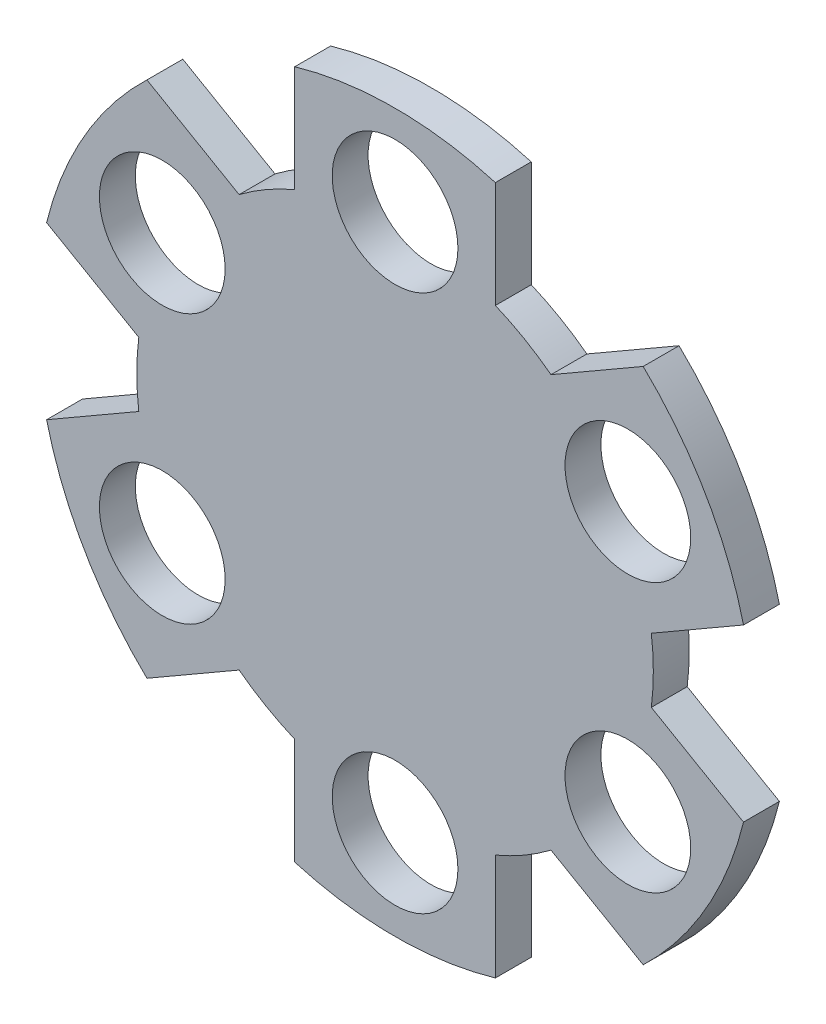
ISO-10303-21;
HEADER;
FILE_DESCRIPTION(('STEP AP214'),'2;1');
FILE_NAME('part.step','',(''),(''),'','','');
FILE_SCHEMA(('AUTOMOTIVE_DESIGN { 1 0 10303 214 1 1 1 1 }'));
ENDSEC;
DATA;
#1=APPLICATION_CONTEXT('core data for automotive mechanical design processes');
#2=APPLICATION_PROTOCOL_DEFINITION('international standard','automotive_design',2000,#1);
#3=PRODUCT_CONTEXT('',#1,'mechanical');
#4=PRODUCT('Part','Part','',(#3));
#5=PRODUCT_RELATED_PRODUCT_CATEGORY('part','',(#4));
#6=PRODUCT_DEFINITION_FORMATION('','',#4);
#7=PRODUCT_DEFINITION_CONTEXT('part definition',#1,'design');
#8=PRODUCT_DEFINITION('design','',#6,#7);
#9=PRODUCT_DEFINITION_SHAPE('','',#8);
#10=(LENGTH_UNIT() NAMED_UNIT(*) SI_UNIT(.MILLI.,.METRE.));
#11=(NAMED_UNIT(*) PLANE_ANGLE_UNIT() SI_UNIT($,.RADIAN.));
#12=(NAMED_UNIT(*) SI_UNIT($,.STERADIAN.) SOLID_ANGLE_UNIT());
#13=UNCERTAINTY_MEASURE_WITH_UNIT(LENGTH_MEASURE(1.E-05),#10,'distance_accuracy_value','');
#14=(GEOMETRIC_REPRESENTATION_CONTEXT(3) GLOBAL_UNCERTAINTY_ASSIGNED_CONTEXT((#13)) GLOBAL_UNIT_ASSIGNED_CONTEXT((#10,
#11,#12)) REPRESENTATION_CONTEXT('',''));
#15=CARTESIAN_POINT('',(0.,0.,0.));
#16=DIRECTION('',(0.,0.,1.));
#17=DIRECTION('',(1.,0.,0.));
#18=AXIS2_PLACEMENT_3D('',#15,#16,#17);
#19=CARTESIAN_POINT('',(0.,0.,3.175));
#20=DIRECTION('',(0.,0.,-1.));
#21=DIRECTION('',(-1.,0.,0.));
#22=AXIS2_PLACEMENT_3D('',#19,#20,#21);
#23=CYLINDRICAL_SURFACE('',#22,31.75);
#24=CARTESIAN_POINT('',(0.,0.,0.));
#25=DIRECTION('',(0.,0.,1.));
#26=DIRECTION('',(1.,0.,0.));
#27=AXIS2_PLACEMENT_3D('',#24,#25,#26);
#28=CIRCLE('',#27,31.75);
#29=CARTESIAN_POINT('',(30.8386744389797,7.5523942459741,0.));
#30=VERTEX_POINT('',#29);
#31=CARTESIAN_POINT('',(21.9599024959468,22.9308783601874,0.));
#32=VERTEX_POINT('',#31);
#33=EDGE_CURVE('E424',#30,#32,#28,.T.);
#34=ORIENTED_EDGE('',*,*,#33,.T.);
#35=DIRECTION('',(0.,0.,-1.));
#36=VECTOR('',#35,1.);
#37=CARTESIAN_POINT('',(21.9599024959468,22.9308783601874,3.175));
#38=LINE('',#37,#36);
#39=CARTESIAN_POINT('',(21.9599024959468,22.9308783601874,3.175));
#40=VERTEX_POINT('',#39);
#41=EDGE_CURVE('E226',#40,#32,#38,.T.);
#42=ORIENTED_EDGE('',*,*,#41,.F.);
#43=CARTESIAN_POINT('',(0.,0.,3.175));
#44=DIRECTION('',(0.,0.,1.));
#45=DIRECTION('',(1.,0.,0.));
#46=AXIS2_PLACEMENT_3D('',#43,#44,#45);
#47=CIRCLE('',#46,31.75);
#48=CARTESIAN_POINT('',(30.8386744390011,7.55239424598647,3.175));
#49=VERTEX_POINT('',#48);
#50=EDGE_CURVE('E437',#49,#40,#47,.T.);
#51=ORIENTED_EDGE('',*,*,#50,.F.);
#52=DIRECTION('',(0.,0.,-1.));
#53=VECTOR('',#52,1.);
#54=CARTESIAN_POINT('',(30.8386744390011,7.55239424598647,3.175));
#55=LINE('',#54,#53);
#56=EDGE_CURVE('E250',#49,#30,#55,.T.);
#57=ORIENTED_EDGE('',*,*,#56,.T.);
#58=EDGE_LOOP('',(#34,#42,#51,#57));
#59=FACE_BOUND('',#58,.T.);
#60=ADVANCED_FACE('F32',(#59),#23,.T.);
#61=CARTESIAN_POINT('',(21.9599024959057,-22.9308783602005,0.));
#62=VERTEX_POINT('',#61);
#63=CARTESIAN_POINT('',(30.8386744390274,-7.55239424603851,0.));
#64=VERTEX_POINT('',#63);
#65=EDGE_CURVE('E427',#62,#64,#28,.T.);
#66=ORIENTED_EDGE('',*,*,#65,.T.);
#67=DIRECTION('',(0.,0.,-1.));
#68=VECTOR('',#67,1.);
#69=CARTESIAN_POINT('',(30.8386744390274,-7.55239424603851,3.175));
#70=LINE('',#69,#68);
#71=CARTESIAN_POINT('',(30.8386744390274,-7.55239424603851,3.175));
#72=VERTEX_POINT('',#71);
#73=EDGE_CURVE('E248',#72,#64,#70,.T.);
#74=ORIENTED_EDGE('',*,*,#73,.F.);
#75=CARTESIAN_POINT('',(21.9599024959611,-22.9308783602325,3.175));
#76=VERTEX_POINT('',#75);
#77=EDGE_CURVE('E459',#76,#72,#47,.T.);
#78=ORIENTED_EDGE('',*,*,#77,.F.);
#79=DIRECTION('',(0.,0.,-1.));
#80=VECTOR('',#79,1.);
#81=CARTESIAN_POINT('',(21.9599024959611,-22.9308783602325,3.175));
#82=LINE('',#81,#80);
#83=EDGE_CURVE('E275',#76,#62,#82,.T.);
#84=ORIENTED_EDGE('',*,*,#83,.T.);
#85=EDGE_LOOP('',(#66,#74,#78,#84));
#86=FACE_BOUND('',#85,.T.);
#87=ADVANCED_FACE('F414',(#86),#23,.T.);
#88=CARTESIAN_POINT('',(-8.87877194303077,-30.4832726061958,0.));
#89=VERTEX_POINT('',#88);
#90=CARTESIAN_POINT('',(8.87877194308978,-30.4832726062678,0.));
#91=VERTEX_POINT('',#90);
#92=EDGE_CURVE('E429',#89,#91,#28,.T.);
#93=ORIENTED_EDGE('',*,*,#92,.T.);
#94=DIRECTION('',(0.,0.,-1.));
#95=VECTOR('',#94,1.);
#96=CARTESIAN_POINT('',(8.87877194308978,-30.4832726062678,3.175));
#97=LINE('',#96,#95);
#98=CARTESIAN_POINT('',(8.87877194308978,-30.4832726062678,3.175));
#99=VERTEX_POINT('',#98);
#100=EDGE_CURVE('E273',#99,#91,#97,.T.);
#101=ORIENTED_EDGE('',*,*,#100,.F.);
#102=CARTESIAN_POINT('',(-8.87877194303078,-30.4832726062609,3.175));
#103=VERTEX_POINT('',#102);
#104=EDGE_CURVE('E457',#103,#99,#47,.T.);
#105=ORIENTED_EDGE('',*,*,#104,.F.);
#106=DIRECTION('',(0.,0.,-1.));
#107=VECTOR('',#106,1.);
#108=CARTESIAN_POINT('',(-8.87877194303078,-30.4832726062609,3.175));
#109=LINE('',#108,#107);
#110=EDGE_CURVE('E301',#103,#89,#109,.T.);
#111=ORIENTED_EDGE('',*,*,#110,.T.);
#112=EDGE_LOOP('',(#93,#101,#105,#111));
#113=FACE_BOUND('',#112,.T.);
#114=ADVANCED_FACE('F419',(#113),#23,.T.);
#115=CARTESIAN_POINT('',(-30.8386744389594,-7.55239424605679,0.));
#116=VERTEX_POINT('',#115);
#117=CARTESIAN_POINT('',(-21.9599024959284,-22.9308783602711,0.));
#118=VERTEX_POINT('',#117);
#119=EDGE_CURVE('E433',#116,#118,#28,.T.);
#120=ORIENTED_EDGE('',*,*,#119,.T.);
#121=DIRECTION('',(0.,0.,-1.));
#122=VECTOR('',#121,1.);
#123=CARTESIAN_POINT('',(-21.9599024959284,-22.9308783602711,3.175));
#124=LINE('',#123,#122);
#125=CARTESIAN_POINT('',(-21.9599024959284,-22.9308783602711,3.175));
#126=VERTEX_POINT('',#125);
#127=EDGE_CURVE('E299',#126,#118,#124,.T.);
#128=ORIENTED_EDGE('',*,*,#127,.F.);
#129=CARTESIAN_POINT('',(-30.8386744389827,-7.55239424607024,3.175));
#130=VERTEX_POINT('',#129);
#131=EDGE_CURVE('E41',#130,#126,#47,.T.);
#132=ORIENTED_EDGE('',*,*,#131,.F.);
#133=DIRECTION('',(0.,0.,-1.));
#134=VECTOR('',#133,1.);
#135=CARTESIAN_POINT('',(-30.8386744389827,-7.55239424607024,3.175));
#136=LINE('',#135,#134);
#137=EDGE_CURVE('E327',#130,#116,#136,.T.);
#138=ORIENTED_EDGE('',*,*,#137,.T.);
#139=EDGE_LOOP('',(#120,#128,#132,#138));
#140=FACE_BOUND('',#139,.T.);
#141=ADVANCED_FACE('F552',(#140),#23,.T.);
#142=CARTESIAN_POINT('',(-21.9599024959534,22.9308783601549,0.));
#143=VERTEX_POINT('',#142);
#144=CARTESIAN_POINT('',(-30.838674439009,7.55239424595475,0.));
#145=VERTEX_POINT('',#144);
#146=EDGE_CURVE('E36',#143,#145,#28,.T.);
#147=ORIENTED_EDGE('',*,*,#146,.T.);
#148=DIRECTION('',(0.,0.,-1.));
#149=VECTOR('',#148,1.);
#150=CARTESIAN_POINT('',(-30.838674439009,7.55239424595475,3.175));
#151=LINE('',#150,#149);
#152=CARTESIAN_POINT('',(-30.838674439009,7.55239424595475,3.175));
#153=VERTEX_POINT('',#152);
#154=EDGE_CURVE('E325',#153,#145,#151,.T.);
#155=ORIENTED_EDGE('',*,*,#154,.F.);
#156=CARTESIAN_POINT('',(-21.9599024959428,22.9308783601487,3.175));
#157=VERTEX_POINT('',#156);
#158=EDGE_CURVE('E11',#157,#153,#47,.T.);
#159=ORIENTED_EDGE('',*,*,#158,.F.);
#160=DIRECTION('',(0.,0.,-1.));
#161=VECTOR('',#160,1.);
#162=CARTESIAN_POINT('',(-21.9599024959428,22.9308783601487,3.175));
#163=LINE('',#162,#161);
#164=EDGE_CURVE('E354',#157,#143,#163,.T.);
#165=ORIENTED_EDGE('',*,*,#164,.T.);
#166=EDGE_LOOP('',(#147,#155,#159,#165));
#167=FACE_BOUND('',#166,.T.);
#168=ADVANCED_FACE('F411',(#167),#23,.T.);
#169=CARTESIAN_POINT('',(0.,0.,3.175));
#170=DIRECTION('',(0.,0.,1.));
#171=DIRECTION('',(1.,0.,0.));
#172=AXIS2_PLACEMENT_3D('',#169,#170,#171);
#173=PLANE('',#172);
#174=DIRECTION('',(-0.866025403784438,-0.500000000000001,0.));
#175=VECTOR('',#174,1.);
#176=CARTESIAN_POINT('',(13.8006085226078,18.2201077882828,3.175));
#177=LINE('',#176,#175);
#178=CARTESIAN_POINT('',(13.8006085226078,18.2201077882828,3.175));
#179=VERTEX_POINT('',#178);
#180=EDGE_CURVE('E204',#40,#179,#177,.T.);
#181=ORIENTED_EDGE('',*,*,#180,.T.);
#182=CARTESIAN_POINT('',(1.45954906846256E-12,-4.35868577823845E-11,3.175));
#183=DIRECTION('',(0.,0.,1.));
#184=DIRECTION('',(1.,0.,0.));
#185=AXIS2_PLACEMENT_3D('',#182,#183,#184);
#186=CIRCLE('',#185,22.8567084990921);
#187=CARTESIAN_POINT('',(8.87877194304915,21.0617314623936,3.175));
#188=VERTEX_POINT('',#187);
#189=EDGE_CURVE('E199',#179,#188,#186,.T.);
#190=ORIENTED_EDGE('',*,*,#189,.T.);
#191=DIRECTION('',(0.,1.,0.));
#192=VECTOR('',#191,1.);
#193=CARTESIAN_POINT('',(8.87877194304915,30.4832726061771,3.175));
#194=LINE('',#193,#192);
#195=CARTESIAN_POINT('',(8.87877194304915,30.4832726061771,3.175));
#196=VERTEX_POINT('',#195);
#197=EDGE_CURVE('E207',#188,#196,#194,.T.);
#198=ORIENTED_EDGE('',*,*,#197,.T.);
#199=CARTESIAN_POINT('',(-8.8787719430714,30.483272606184,3.175));
#200=VERTEX_POINT('',#199);
#201=EDGE_CURVE('E42',#196,#200,#47,.T.);
#202=ORIENTED_EDGE('',*,*,#201,.T.);
#203=DIRECTION('',(0.,-1.,0.));
#204=VECTOR('',#203,1.);
#205=CARTESIAN_POINT('',(-8.87877194307139,21.0617314623749,3.175));
#206=LINE('',#205,#204);
#207=CARTESIAN_POINT('',(-8.87877194307139,21.0617314623749,3.175));
#208=VERTEX_POINT('',#207);
#209=EDGE_CURVE('E338',#200,#208,#206,.T.);
#210=ORIENTED_EDGE('',*,*,#209,.T.);
#211=CARTESIAN_POINT('',(1.69316229452944E-11,-4.01642589743796E-11,3.175));
#212=DIRECTION('',(0.,0.,1.));
#213=DIRECTION('',(1.,0.,0.));
#214=AXIS2_PLACEMENT_3D('',#211,#212,#213);
#215=CIRCLE('',#214,22.8567084990891);
#216=CARTESIAN_POINT('',(-13.8006085226259,18.220107788257,3.175));
#217=VERTEX_POINT('',#216);
#218=EDGE_CURVE('E331',#208,#217,#215,.T.);
#219=ORIENTED_EDGE('',*,*,#218,.T.);
#220=DIRECTION('',(-0.866025403784439,0.5,0.));
#221=VECTOR('',#220,1.);
#222=CARTESIAN_POINT('',(-13.8006085226259,18.220107788257,3.175));
#223=LINE('',#222,#221);
#224=EDGE_CURVE('E334',#217,#157,#223,.T.);
#225=ORIENTED_EDGE('',*,*,#224,.T.);
#226=ORIENTED_EDGE('',*,*,#158,.T.);
#227=DIRECTION('',(0.866025403784439,-0.499999999999999,0.));
#228=VECTOR('',#227,1.);
#229=CARTESIAN_POINT('',(-22.67938046567,2.84162367405021,3.175));
#230=LINE('',#229,#228);
#231=CARTESIAN_POINT('',(-22.67938046567,2.84162367405021,3.175));
#232=VERTEX_POINT('',#231);
#233=EDGE_CURVE('E312',#153,#232,#230,.T.);
#234=ORIENTED_EDGE('',*,*,#233,.T.);
#235=CARTESIAN_POINT('',(1.15815757187391E-11,-3.43203041630979E-11,3.175));
#236=DIRECTION('',(0.,0.,1.));
#237=DIRECTION('',(1.,0.,0.));
#238=AXIS2_PLACEMENT_3D('',#235,#236,#237);
#239=CIRCLE('',#238,22.8567084990891);
#240=CARTESIAN_POINT('',(-22.6793804656659,-2.84162367417849,3.175));
#241=VERTEX_POINT('',#240);
#242=EDGE_CURVE('E305',#232,#241,#239,.T.);
#243=ORIENTED_EDGE('',*,*,#242,.T.);
#244=DIRECTION('',(-0.866025403784439,-0.5,0.));
#245=VECTOR('',#244,1.);
#246=CARTESIAN_POINT('',(-22.6793804656659,-2.84162367417849,3.175));
#247=LINE('',#246,#245);
#248=EDGE_CURVE('E308',#241,#130,#247,.T.);
#249=ORIENTED_EDGE('',*,*,#248,.T.);
#250=ORIENTED_EDGE('',*,*,#131,.T.);
#251=DIRECTION('',(0.866025403784438,0.500000000000001,0.));
#252=VECTOR('',#251,1.);
#253=CARTESIAN_POINT('',(-13.8006085225894,-18.2201077883666,3.175));
#254=LINE('',#253,#252);
#255=CARTESIAN_POINT('',(-13.8006085225894,-18.2201077883666,3.175));
#256=VERTEX_POINT('',#255);
#257=EDGE_CURVE('E286',#126,#256,#254,.T.);
#258=ORIENTED_EDGE('',*,*,#257,.T.);
#259=CARTESIAN_POINT('',(3.84553878032322E-12,-3.60316035671003E-11,3.175));
#260=DIRECTION('',(0.,0.,1.));
#261=DIRECTION('',(1.,0.,0.));
#262=AXIS2_PLACEMENT_3D('',#259,#260,#261);
#263=CIRCLE('',#262,22.8567084990891);
#264=CARTESIAN_POINT('',(-8.87877194303077,-21.0617314624774,3.175));
#265=VERTEX_POINT('',#264);
#266=EDGE_CURVE('E279',#256,#265,#263,.T.);
#267=ORIENTED_EDGE('',*,*,#266,.T.);
#268=DIRECTION('',(0.,-1.,0.));
#269=VECTOR('',#268,1.);
#270=CARTESIAN_POINT('',(-8.87877194303077,-21.0617314624774,3.175));
#271=LINE('',#270,#269);
#272=EDGE_CURVE('E282',#265,#103,#271,.T.);
#273=ORIENTED_EDGE('',*,*,#272,.T.);
#274=ORIENTED_EDGE('',*,*,#104,.T.);
#275=DIRECTION('',(0.,1.,0.));
#276=VECTOR('',#275,1.);
#277=CARTESIAN_POINT('',(8.87877194308978,-21.0617314624587,3.175));
#278=LINE('',#277,#276);
#279=CARTESIAN_POINT('',(8.87877194308978,-21.0617314624587,3.175));
#280=VERTEX_POINT('',#279);
#281=EDGE_CURVE('E260',#99,#280,#278,.T.);
#282=ORIENTED_EDGE('',*,*,#281,.T.);
#283=CARTESIAN_POINT('',(1.45954906846256E-12,-4.35868577823845E-11,3.175));
#284=DIRECTION('',(0.,0.,1.));
#285=DIRECTION('',(1.,0.,0.));
#286=AXIS2_PLACEMENT_3D('',#283,#284,#285);
#287=CIRCLE('',#286,22.8567084990891);
#288=CARTESIAN_POINT('',(13.8006085226443,-18.2201077883407,3.175));
#289=VERTEX_POINT('',#288);
#290=EDGE_CURVE('E253',#280,#289,#287,.T.);
#291=ORIENTED_EDGE('',*,*,#290,.T.);
#292=DIRECTION('',(0.866025403784438,-0.5,0.));
#293=VECTOR('',#292,1.);
#294=CARTESIAN_POINT('',(13.8006085226443,-18.2201077883407,3.175));
#295=LINE('',#294,#293);
#296=EDGE_CURVE('E256',#289,#76,#295,.T.);
#297=ORIENTED_EDGE('',*,*,#296,.T.);
#298=ORIENTED_EDGE('',*,*,#77,.T.);
#299=DIRECTION('',(-0.866025403784439,0.5,0.));
#300=VECTOR('',#299,1.);
#301=CARTESIAN_POINT('',(22.6793804656884,-2.84162367413396,3.175));
#302=LINE('',#301,#300);
#303=CARTESIAN_POINT('',(22.6793804656884,-2.84162367413396,3.175));
#304=VERTEX_POINT('',#303);
#305=EDGE_CURVE('E236',#72,#304,#302,.T.);
#306=ORIENTED_EDGE('',*,*,#305,.T.);
#307=CARTESIAN_POINT('',(6.80959629501781E-12,-4.94308125936663E-11,3.175));
#308=DIRECTION('',(0.,0.,1.));
#309=DIRECTION('',(1.,0.,0.));
#310=AXIS2_PLACEMENT_3D('',#307,#308,#309);
#311=CIRCLE('',#310,22.8567084990891);
#312=CARTESIAN_POINT('',(22.6793804656843,2.84162367409473,3.175));
#313=VERTEX_POINT('',#312);
#314=EDGE_CURVE('E229',#304,#313,#311,.T.);
#315=ORIENTED_EDGE('',*,*,#314,.T.);
#316=DIRECTION('',(0.866025403784439,0.5,0.));
#317=VECTOR('',#316,1.);
#318=CARTESIAN_POINT('',(22.6793804656843,2.84162367409473,3.175));
#319=LINE('',#318,#317);
#320=EDGE_CURVE('E232',#313,#49,#319,.T.);
#321=ORIENTED_EDGE('',*,*,#320,.T.);
#322=ORIENTED_EDGE('',*,*,#50,.T.);
#323=EDGE_LOOP('',(#181,#190,#198,#202,#210,#219,#225,#226,#234,#243,#249,#250,#258,#267,#273,
#274,#282,#291,#297,#298,#306,#315,#321,#322));
#324=FACE_BOUND('',#323,.T.);
#325=CARTESIAN_POINT('',(-20.6025178388072,-11.8948692202191,3.175));
#326=DIRECTION('',(0.,0.,1.));
#327=DIRECTION('',(1.,0.,0.));
#328=AXIS2_PLACEMENT_3D('',#325,#326,#327);
#329=CIRCLE('',#328,5.5626);
#330=CARTESIAN_POINT('',(-15.0399178388072,-11.8948692202191,3.175));
#331=VERTEX_POINT('',#330);
#332=EDGE_CURVE('E364',#331,#331,#329,.T.);
#333=ORIENTED_EDGE('',*,*,#332,.F.);
#334=EDGE_LOOP('',(#333));
#335=FACE_BOUND('',#334,.T.);
#336=CARTESIAN_POINT('',(20.602517838807,-11.8948692202194,3.175));
#337=DIRECTION('',(0.,0.,1.));
#338=DIRECTION('',(1.,0.,0.));
#339=AXIS2_PLACEMENT_3D('',#336,#337,#338);
#340=CIRCLE('',#339,5.5626);
#341=CARTESIAN_POINT('',(26.165117838807,-11.8948692202194,3.175));
#342=VERTEX_POINT('',#341);
#343=EDGE_CURVE('E376',#342,#342,#340,.T.);
#344=ORIENTED_EDGE('',*,*,#343,.F.);
#345=EDGE_LOOP('',(#344));
#346=FACE_BOUND('',#345,.T.);
#347=CARTESIAN_POINT('',(0.,23.7897384404387,3.175));
#348=DIRECTION('',(0.,0.,1.));
#349=DIRECTION('',(1.,0.,0.));
#350=AXIS2_PLACEMENT_3D('',#347,#348,#349);
#351=CIRCLE('',#350,5.5626);
#352=CARTESIAN_POINT('',(5.5626,23.7897384404387,3.175));
#353=VERTEX_POINT('',#352);
#354=EDGE_CURVE('E388',#353,#353,#351,.T.);
#355=ORIENTED_EDGE('',*,*,#354,.F.);
#356=EDGE_LOOP('',(#355));
#357=FACE_BOUND('',#356,.T.);
#358=CARTESIAN_POINT('',(20.6025178388071,11.8948692202193,3.175));
#359=DIRECTION('',(0.,0.,1.));
#360=DIRECTION('',(1.,0.,0.));
#361=AXIS2_PLACEMENT_3D('',#358,#359,#360);
#362=CIRCLE('',#361,5.5626);
#363=CARTESIAN_POINT('',(26.1651178388071,11.8948692202193,3.175));
#364=VERTEX_POINT('',#363);
#365=EDGE_CURVE('E382',#364,#364,#362,.T.);
#366=ORIENTED_EDGE('',*,*,#365,.F.);
#367=EDGE_LOOP('',(#366));
#368=FACE_BOUND('',#367,.T.);
#369=CARTESIAN_POINT('',(-1.66122951859872E-13,-23.7897384404387,3.175));
#370=DIRECTION('',(0.,0.,1.));
#371=DIRECTION('',(1.,0.,0.));
#372=AXIS2_PLACEMENT_3D('',#369,#370,#371);
#373=CIRCLE('',#372,5.5626);
#374=CARTESIAN_POINT('',(5.56259999999983,-23.7897384404387,3.175));
#375=VERTEX_POINT('',#374);
#376=EDGE_CURVE('E370',#375,#375,#373,.T.);
#377=ORIENTED_EDGE('',*,*,#376,.F.);
#378=EDGE_LOOP('',(#377));
#379=FACE_BOUND('',#378,.T.);
#380=CARTESIAN_POINT('',(-20.6025178388069,11.8948692202196,3.175));
#381=DIRECTION('',(0.,0.,1.));
#382=DIRECTION('',(1.,0.,0.));
#383=AXIS2_PLACEMENT_3D('',#380,#381,#382);
#384=CIRCLE('',#383,5.5626);
#385=CARTESIAN_POINT('',(-15.0399178388069,11.8948692202196,3.175));
#386=VERTEX_POINT('',#385);
#387=EDGE_CURVE('E358',#386,#386,#384,.T.);
#388=ORIENTED_EDGE('',*,*,#387,.F.);
#389=EDGE_LOOP('',(#388));
#390=FACE_BOUND('',#389,.T.);
#391=ADVANCED_FACE('F212',(#324,#335,#346,#357,#368,#379,#390),#173,.T.);
#392=CARTESIAN_POINT('',(0.,0.,0.));
#393=DIRECTION('',(0.,0.,1.));
#394=DIRECTION('',(1.,0.,0.));
#395=AXIS2_PLACEMENT_3D('',#392,#393,#394);
#396=PLANE('',#395);
#397=CARTESIAN_POINT('',(-20.6025178388072,-11.8948692202191,0.));
#398=DIRECTION('',(0.,0.,1.));
#399=DIRECTION('',(1.,0.,0.));
#400=AXIS2_PLACEMENT_3D('',#397,#398,#399);
#401=CIRCLE('',#400,5.5626);
#402=CARTESIAN_POINT('',(-15.0399178388072,-11.8948692202191,0.));
#403=VERTEX_POINT('',#402);
#404=EDGE_CURVE('E361',#403,#403,#401,.T.);
#405=ORIENTED_EDGE('',*,*,#404,.T.);
#406=EDGE_LOOP('',(#405));
#407=FACE_BOUND('',#406,.T.);
#408=CARTESIAN_POINT('',(20.602517838807,-11.8948692202194,0.));
#409=DIRECTION('',(0.,0.,1.));
#410=DIRECTION('',(1.,0.,0.));
#411=AXIS2_PLACEMENT_3D('',#408,#409,#410);
#412=CIRCLE('',#411,5.5626);
#413=CARTESIAN_POINT('',(26.165117838807,-11.8948692202194,0.));
#414=VERTEX_POINT('',#413);
#415=EDGE_CURVE('E373',#414,#414,#412,.T.);
#416=ORIENTED_EDGE('',*,*,#415,.T.);
#417=EDGE_LOOP('',(#416));
#418=FACE_BOUND('',#417,.T.);
#419=CARTESIAN_POINT('',(0.,23.7897384404387,0.));
#420=DIRECTION('',(0.,0.,1.));
#421=DIRECTION('',(1.,0.,0.));
#422=AXIS2_PLACEMENT_3D('',#419,#420,#421);
#423=CIRCLE('',#422,5.5626);
#424=CARTESIAN_POINT('',(5.5626,23.7897384404387,0.));
#425=VERTEX_POINT('',#424);
#426=EDGE_CURVE('E385',#425,#425,#423,.T.);
#427=ORIENTED_EDGE('',*,*,#426,.T.);
#428=EDGE_LOOP('',(#427));
#429=FACE_BOUND('',#428,.T.);
#430=CARTESIAN_POINT('',(1.45954906846256E-12,-4.35868577823845E-11,0.));
#431=DIRECTION('',(0.,0.,1.));
#432=DIRECTION('',(1.,0.,0.));
#433=AXIS2_PLACEMENT_3D('',#430,#431,#432);
#434=CIRCLE('',#433,22.8567084990921);
#435=CARTESIAN_POINT('',(13.8006085226078,18.2201077882828,0.));
#436=VERTEX_POINT('',#435);
#437=CARTESIAN_POINT('',(8.87877194304915,21.0617314623936,0.));
#438=VERTEX_POINT('',#437);
#439=EDGE_CURVE('E202',#436,#438,#434,.T.);
#440=ORIENTED_EDGE('',*,*,#439,.F.);
#441=DIRECTION('',(-0.866025403784438,-0.500000000000001,0.));
#442=VECTOR('',#441,1.);
#443=CARTESIAN_POINT('',(13.8006085226078,18.2201077882828,0.));
#444=LINE('',#443,#442);
#445=EDGE_CURVE('E215',#32,#436,#444,.T.);
#446=ORIENTED_EDGE('',*,*,#445,.F.);
#447=ORIENTED_EDGE('',*,*,#33,.F.);
#448=DIRECTION('',(0.866025403784439,0.5,0.));
#449=VECTOR('',#448,1.);
#450=CARTESIAN_POINT('',(22.6793804656843,2.84162367409473,0.));
#451=LINE('',#450,#449);
#452=CARTESIAN_POINT('',(22.6793804656843,2.84162367409473,0.));
#453=VERTEX_POINT('',#452);
#454=EDGE_CURVE('E57',#453,#30,#451,.T.);
#455=ORIENTED_EDGE('',*,*,#454,.F.);
#456=CARTESIAN_POINT('',(6.80959629501781E-12,-4.94308125936663E-11,0.));
#457=DIRECTION('',(0.,0.,1.));
#458=DIRECTION('',(1.,0.,0.));
#459=AXIS2_PLACEMENT_3D('',#456,#457,#458);
#460=CIRCLE('',#459,22.8567084990891);
#461=CARTESIAN_POINT('',(22.6793804656884,-2.84162367413396,0.));
#462=VERTEX_POINT('',#461);
#463=EDGE_CURVE('E225',#462,#453,#460,.T.);
#464=ORIENTED_EDGE('',*,*,#463,.F.);
#465=DIRECTION('',(-0.866025403784439,0.5,0.));
#466=VECTOR('',#465,1.);
#467=CARTESIAN_POINT('',(22.6793804656884,-2.84162367413396,0.));
#468=LINE('',#467,#466);
#469=EDGE_CURVE('E233',#64,#462,#468,.T.);
#470=ORIENTED_EDGE('',*,*,#469,.F.);
#471=ORIENTED_EDGE('',*,*,#65,.F.);
#472=DIRECTION('',(0.866025403784438,-0.5,0.));
#473=VECTOR('',#472,1.);
#474=CARTESIAN_POINT('',(13.8006085226443,-18.2201077883407,0.));
#475=LINE('',#474,#473);
#476=CARTESIAN_POINT('',(13.8006085226443,-18.2201077883407,0.));
#477=VERTEX_POINT('',#476);
#478=EDGE_CURVE('E266',#477,#62,#475,.T.);
#479=ORIENTED_EDGE('',*,*,#478,.F.);
#480=CARTESIAN_POINT('',(1.45954906846256E-12,-4.35868577823845E-11,0.));
#481=DIRECTION('',(0.,0.,1.));
#482=DIRECTION('',(1.,0.,0.));
#483=AXIS2_PLACEMENT_3D('',#480,#481,#482);
#484=CIRCLE('',#483,22.8567084990891);
#485=CARTESIAN_POINT('',(8.87877194308978,-21.0617314624587,0.));
#486=VERTEX_POINT('',#485);
#487=EDGE_CURVE('E247',#486,#477,#484,.T.);
#488=ORIENTED_EDGE('',*,*,#487,.F.);
#489=DIRECTION('',(0.,1.,0.));
#490=VECTOR('',#489,1.);
#491=CARTESIAN_POINT('',(8.87877194308978,-21.0617314624587,0.));
#492=LINE('',#491,#490);
#493=EDGE_CURVE('E257',#91,#486,#492,.T.);
#494=ORIENTED_EDGE('',*,*,#493,.F.);
#495=ORIENTED_EDGE('',*,*,#92,.F.);
#496=DIRECTION('',(0.,-1.,0.));
#497=VECTOR('',#496,1.);
#498=CARTESIAN_POINT('',(-8.87877194303077,-21.0617314624774,0.));
#499=LINE('',#498,#497);
#500=CARTESIAN_POINT('',(-8.87877194303077,-21.0617314624774,0.));
#501=VERTEX_POINT('',#500);
#502=EDGE_CURVE('E292',#501,#89,#499,.T.);
#503=ORIENTED_EDGE('',*,*,#502,.F.);
#504=CARTESIAN_POINT('',(3.84553878032322E-12,-3.60316035671003E-11,0.));
#505=DIRECTION('',(0.,0.,1.));
#506=DIRECTION('',(1.,0.,0.));
#507=AXIS2_PLACEMENT_3D('',#504,#505,#506);
#508=CIRCLE('',#507,22.8567084990891);
#509=CARTESIAN_POINT('',(-13.8006085225894,-18.2201077883666,0.));
#510=VERTEX_POINT('',#509);
#511=EDGE_CURVE('E272',#510,#501,#508,.T.);
#512=ORIENTED_EDGE('',*,*,#511,.F.);
#513=DIRECTION('',(0.866025403784438,0.500000000000001,0.));
#514=VECTOR('',#513,1.);
#515=CARTESIAN_POINT('',(-13.8006085225894,-18.2201077883666,0.));
#516=LINE('',#515,#514);
#517=EDGE_CURVE('E283',#118,#510,#516,.T.);
#518=ORIENTED_EDGE('',*,*,#517,.F.);
#519=ORIENTED_EDGE('',*,*,#119,.F.);
#520=DIRECTION('',(-0.866025403784439,-0.5,0.));
#521=VECTOR('',#520,1.);
#522=CARTESIAN_POINT('',(-22.6793804656659,-2.84162367417849,0.));
#523=LINE('',#522,#521);
#524=CARTESIAN_POINT('',(-22.6793804656659,-2.84162367417849,0.));
#525=VERTEX_POINT('',#524);
#526=EDGE_CURVE('E318',#525,#116,#523,.T.);
#527=ORIENTED_EDGE('',*,*,#526,.F.);
#528=CARTESIAN_POINT('',(1.15815757187391E-11,-3.43203041630979E-11,0.));
#529=DIRECTION('',(0.,0.,1.));
#530=DIRECTION('',(1.,0.,0.));
#531=AXIS2_PLACEMENT_3D('',#528,#529,#530);
#532=CIRCLE('',#531,22.8567084990891);
#533=CARTESIAN_POINT('',(-22.67938046567,2.84162367405021,0.));
#534=VERTEX_POINT('',#533);
#535=EDGE_CURVE('E298',#534,#525,#532,.T.);
#536=ORIENTED_EDGE('',*,*,#535,.F.);
#537=DIRECTION('',(0.866025403784439,-0.499999999999999,0.));
#538=VECTOR('',#537,1.);
#539=CARTESIAN_POINT('',(-22.67938046567,2.84162367405021,0.));
#540=LINE('',#539,#538);
#541=EDGE_CURVE('E309',#145,#534,#540,.T.);
#542=ORIENTED_EDGE('',*,*,#541,.F.);
#543=ORIENTED_EDGE('',*,*,#146,.F.);
#544=DIRECTION('',(-0.866025403784439,0.5,0.));
#545=VECTOR('',#544,1.);
#546=CARTESIAN_POINT('',(-13.8006085226259,18.220107788257,0.));
#547=LINE('',#546,#545);
#548=CARTESIAN_POINT('',(-13.8006085226259,18.220107788257,0.));
#549=VERTEX_POINT('',#548);
#550=EDGE_CURVE('E344',#549,#143,#547,.T.);
#551=ORIENTED_EDGE('',*,*,#550,.F.);
#552=CARTESIAN_POINT('',(1.69316229452944E-11,-4.01642589743796E-11,0.));
#553=DIRECTION('',(0.,0.,1.));
#554=DIRECTION('',(1.,0.,0.));
#555=AXIS2_PLACEMENT_3D('',#552,#553,#554);
#556=CIRCLE('',#555,22.8567084990891);
#557=CARTESIAN_POINT('',(-8.87877194307139,21.0617314623749,0.));
#558=VERTEX_POINT('',#557);
#559=EDGE_CURVE('E324',#558,#549,#556,.T.);
#560=ORIENTED_EDGE('',*,*,#559,.F.);
#561=DIRECTION('',(0.,-1.,0.));
#562=VECTOR('',#561,1.);
#563=CARTESIAN_POINT('',(-8.87877194307139,21.0617314623749,0.));
#564=LINE('',#563,#562);
#565=CARTESIAN_POINT('',(-8.8787719430714,30.483272606184,0.));
#566=VERTEX_POINT('',#565);
#567=EDGE_CURVE('E335',#566,#558,#564,.T.);
#568=ORIENTED_EDGE('',*,*,#567,.F.);
#569=CARTESIAN_POINT('',(8.87877194304915,30.4832726061905,0.));
#570=VERTEX_POINT('',#569);
#571=EDGE_CURVE('E391',#570,#566,#28,.T.);
#572=ORIENTED_EDGE('',*,*,#571,.F.);
#573=DIRECTION('',(0.,1.,0.));
#574=VECTOR('',#573,1.);
#575=CARTESIAN_POINT('',(8.87877194304915,30.4832726061771,0.));
#576=LINE('',#575,#574);
#577=EDGE_CURVE('E49',#438,#570,#576,.T.);
#578=ORIENTED_EDGE('',*,*,#577,.F.);
#579=EDGE_LOOP('',(#440,#446,#447,#455,#464,#470,#471,#479,#488,#494,#495,#503,#512,#518,#519,
#527,#536,#542,#543,#551,#560,#568,#572,#578));
#580=FACE_BOUND('',#579,.T.);
#581=CARTESIAN_POINT('',(20.6025178388071,11.8948692202193,0.));
#582=DIRECTION('',(0.,0.,1.));
#583=DIRECTION('',(1.,0.,0.));
#584=AXIS2_PLACEMENT_3D('',#581,#582,#583);
#585=CIRCLE('',#584,5.5626);
#586=CARTESIAN_POINT('',(26.1651178388071,11.8948692202193,0.));
#587=VERTEX_POINT('',#586);
#588=EDGE_CURVE('E379',#587,#587,#585,.T.);
#589=ORIENTED_EDGE('',*,*,#588,.T.);
#590=EDGE_LOOP('',(#589));
#591=FACE_BOUND('',#590,.T.);
#592=CARTESIAN_POINT('',(-1.66122951859872E-13,-23.7897384404387,0.));
#593=DIRECTION('',(0.,0.,1.));
#594=DIRECTION('',(1.,0.,0.));
#595=AXIS2_PLACEMENT_3D('',#592,#593,#594);
#596=CIRCLE('',#595,5.5626);
#597=CARTESIAN_POINT('',(5.56259999999983,-23.7897384404387,0.));
#598=VERTEX_POINT('',#597);
#599=EDGE_CURVE('E367',#598,#598,#596,.T.);
#600=ORIENTED_EDGE('',*,*,#599,.T.);
#601=EDGE_LOOP('',(#600));
#602=FACE_BOUND('',#601,.T.);
#603=CARTESIAN_POINT('',(-20.6025178388069,11.8948692202196,0.));
#604=DIRECTION('',(0.,0.,1.));
#605=DIRECTION('',(1.,0.,0.));
#606=AXIS2_PLACEMENT_3D('',#603,#604,#605);
#607=CIRCLE('',#606,5.5626);
#608=CARTESIAN_POINT('',(-15.0399178388069,11.8948692202196,0.));
#609=VERTEX_POINT('',#608);
#610=EDGE_CURVE('E350',#609,#609,#607,.T.);
#611=ORIENTED_EDGE('',*,*,#610,.T.);
#612=EDGE_LOOP('',(#611));
#613=FACE_BOUND('',#612,.T.);
#614=ADVANCED_FACE('F395',(#407,#418,#429,#580,#591,#602,#613),#396,.F.);
#615=ORIENTED_EDGE('',*,*,#201,.F.);
#616=DIRECTION('',(0.,0.,-1.));
#617=VECTOR('',#616,1.);
#618=CARTESIAN_POINT('',(8.87877194304915,30.4832726061771,3.175));
#619=LINE('',#618,#617);
#620=EDGE_CURVE('E203',#196,#570,#619,.T.);
#621=ORIENTED_EDGE('',*,*,#620,.T.);
#622=ORIENTED_EDGE('',*,*,#571,.T.);
#623=DIRECTION('',(0.,0.,-1.));
#624=VECTOR('',#623,1.);
#625=CARTESIAN_POINT('',(-8.8787719430714,30.483272606184,3.175));
#626=LINE('',#625,#624);
#627=EDGE_CURVE('E351',#200,#566,#626,.T.);
#628=ORIENTED_EDGE('',*,*,#627,.F.);
#629=EDGE_LOOP('',(#615,#621,#622,#628));
#630=FACE_BOUND('',#629,.T.);
#631=ADVANCED_FACE('F34',(#630),#23,.T.);
#632=CARTESIAN_POINT('',(0.,23.7897384404387,3.175));
#633=DIRECTION('',(0.,0.,-1.));
#634=DIRECTION('',(-1.,0.,0.));
#635=AXIS2_PLACEMENT_3D('',#632,#633,#634);
#636=CYLINDRICAL_SURFACE('',#635,5.5626);
#637=ORIENTED_EDGE('',*,*,#354,.T.);
#638=EDGE_LOOP('',(#637));
#639=FACE_BOUND('',#638,.T.);
#640=ORIENTED_EDGE('',*,*,#426,.F.);
#641=EDGE_LOOP('',(#640));
#642=FACE_BOUND('',#641,.T.);
#643=ADVANCED_FACE('F398',(#639,#642),#636,.F.);
#644=CARTESIAN_POINT('',(20.6025178388071,11.8948692202193,3.175));
#645=DIRECTION('',(0.,0.,-1.));
#646=DIRECTION('',(-1.,0.,0.));
#647=AXIS2_PLACEMENT_3D('',#644,#645,#646);
#648=CYLINDRICAL_SURFACE('',#647,5.5626);
#649=ORIENTED_EDGE('',*,*,#365,.T.);
#650=EDGE_LOOP('',(#649));
#651=FACE_BOUND('',#650,.T.);
#652=ORIENTED_EDGE('',*,*,#588,.F.);
#653=EDGE_LOOP('',(#652));
#654=FACE_BOUND('',#653,.T.);
#655=ADVANCED_FACE('F400',(#651,#654),#648,.F.);
#656=CARTESIAN_POINT('',(20.602517838807,-11.8948692202194,3.175));
#657=DIRECTION('',(0.,0.,-1.));
#658=DIRECTION('',(-1.,0.,0.));
#659=AXIS2_PLACEMENT_3D('',#656,#657,#658);
#660=CYLINDRICAL_SURFACE('',#659,5.5626);
#661=ORIENTED_EDGE('',*,*,#343,.T.);
#662=EDGE_LOOP('',(#661));
#663=FACE_BOUND('',#662,.T.);
#664=ORIENTED_EDGE('',*,*,#415,.F.);
#665=EDGE_LOOP('',(#664));
#666=FACE_BOUND('',#665,.T.);
#667=ADVANCED_FACE('F407',(#663,#666),#660,.F.);
#668=CARTESIAN_POINT('',(-1.66122951859872E-13,-23.7897384404387,3.175));
#669=DIRECTION('',(0.,0.,-1.));
#670=DIRECTION('',(-1.,0.,0.));
#671=AXIS2_PLACEMENT_3D('',#668,#669,#670);
#672=CYLINDRICAL_SURFACE('',#671,5.5626);
#673=ORIENTED_EDGE('',*,*,#376,.T.);
#674=EDGE_LOOP('',(#673));
#675=FACE_BOUND('',#674,.T.);
#676=ORIENTED_EDGE('',*,*,#599,.F.);
#677=EDGE_LOOP('',(#676));
#678=FACE_BOUND('',#677,.T.);
#679=ADVANCED_FACE('F529',(#675,#678),#672,.F.);
#680=CARTESIAN_POINT('',(-20.6025178388072,-11.8948692202191,3.175));
#681=DIRECTION('',(0.,0.,-1.));
#682=DIRECTION('',(-1.,0.,0.));
#683=AXIS2_PLACEMENT_3D('',#680,#681,#682);
#684=CYLINDRICAL_SURFACE('',#683,5.5626);
#685=ORIENTED_EDGE('',*,*,#332,.T.);
#686=EDGE_LOOP('',(#685));
#687=FACE_BOUND('',#686,.T.);
#688=ORIENTED_EDGE('',*,*,#404,.F.);
#689=EDGE_LOOP('',(#688));
#690=FACE_BOUND('',#689,.T.);
#691=ADVANCED_FACE('F525',(#687,#690),#684,.F.);
#692=CARTESIAN_POINT('',(-20.6025178388069,11.8948692202196,3.175));
#693=DIRECTION('',(0.,0.,-1.));
#694=DIRECTION('',(-1.,0.,0.));
#695=AXIS2_PLACEMENT_3D('',#692,#693,#694);
#696=CYLINDRICAL_SURFACE('',#695,5.5626);
#697=ORIENTED_EDGE('',*,*,#387,.T.);
#698=EDGE_LOOP('',(#697));
#699=FACE_BOUND('',#698,.T.);
#700=ORIENTED_EDGE('',*,*,#610,.F.);
#701=EDGE_LOOP('',(#700));
#702=FACE_BOUND('',#701,.T.);
#703=ADVANCED_FACE('F521',(#699,#702),#696,.F.);
#704=CARTESIAN_POINT('',(1.69316229452944E-11,-4.01642589743796E-11,3.175));
#705=DIRECTION('',(0.,0.,-1.));
#706=DIRECTION('',(-1.,0.,0.));
#707=AXIS2_PLACEMENT_3D('',#704,#705,#706);
#708=CYLINDRICAL_SURFACE('',#707,22.8567084990891);
#709=ORIENTED_EDGE('',*,*,#559,.T.);
#710=DIRECTION('',(0.,0.,-1.));
#711=VECTOR('',#710,1.);
#712=CARTESIAN_POINT('',(-13.8006085226259,18.220107788257,3.175));
#713=LINE('',#712,#711);
#714=EDGE_CURVE('E341',#217,#549,#713,.T.);
#715=ORIENTED_EDGE('',*,*,#714,.F.);
#716=ORIENTED_EDGE('',*,*,#218,.F.);
#717=DIRECTION('',(0.,0.,-1.));
#718=VECTOR('',#717,1.);
#719=CARTESIAN_POINT('',(-8.87877194307139,21.0617314623749,3.175));
#720=LINE('',#719,#718);
#721=EDGE_CURVE('E348',#208,#558,#720,.T.);
#722=ORIENTED_EDGE('',*,*,#721,.T.);
#723=EDGE_LOOP('',(#709,#715,#716,#722));
#724=FACE_BOUND('',#723,.T.);
#725=ADVANCED_FACE('F514',(#724),#708,.T.);
#726=CARTESIAN_POINT('',(-8.87877194307139,21.0617314623749,3.175));
#727=DIRECTION('',(1.,0.,0.));
#728=DIRECTION('',(0.,1.,0.));
#729=AXIS2_PLACEMENT_3D('',#726,#727,#728);
#730=PLANE('',#729);
#731=ORIENTED_EDGE('',*,*,#567,.T.);
#732=ORIENTED_EDGE('',*,*,#721,.F.);
#733=ORIENTED_EDGE('',*,*,#209,.F.);
#734=ORIENTED_EDGE('',*,*,#627,.T.);
#735=EDGE_LOOP('',(#731,#732,#733,#734));
#736=FACE_BOUND('',#735,.T.);
#737=ADVANCED_FACE('F511',(#736),#730,.F.);
#738=CARTESIAN_POINT('',(-13.8006085226259,18.220107788257,3.175));
#739=DIRECTION('',(-0.5,-0.866025403784439,0.));
#740=DIRECTION('',(0.866025403784439,-0.5,0.));
#741=AXIS2_PLACEMENT_3D('',#738,#739,#740);
#742=PLANE('',#741);
#743=ORIENTED_EDGE('',*,*,#550,.T.);
#744=ORIENTED_EDGE('',*,*,#164,.F.);
#745=ORIENTED_EDGE('',*,*,#224,.F.);
#746=ORIENTED_EDGE('',*,*,#714,.T.);
#747=EDGE_LOOP('',(#743,#744,#745,#746));
#748=FACE_BOUND('',#747,.T.);
#749=ADVANCED_FACE('F509',(#748),#742,.F.);
#750=CARTESIAN_POINT('',(1.15815757187391E-11,-3.43203041630979E-11,3.175));
#751=DIRECTION('',(0.,0.,-1.));
#752=DIRECTION('',(-1.,0.,0.));
#753=AXIS2_PLACEMENT_3D('',#750,#751,#752);
#754=CYLINDRICAL_SURFACE('',#753,22.8567084990891);
#755=ORIENTED_EDGE('',*,*,#535,.T.);
#756=DIRECTION('',(0.,0.,-1.));
#757=VECTOR('',#756,1.);
#758=CARTESIAN_POINT('',(-22.6793804656659,-2.84162367417849,3.175));
#759=LINE('',#758,#757);
#760=EDGE_CURVE('E315',#241,#525,#759,.T.);
#761=ORIENTED_EDGE('',*,*,#760,.F.);
#762=ORIENTED_EDGE('',*,*,#242,.F.);
#763=DIRECTION('',(0.,0.,-1.));
#764=VECTOR('',#763,1.);
#765=CARTESIAN_POINT('',(-22.67938046567,2.84162367405021,3.175));
#766=LINE('',#765,#764);
#767=EDGE_CURVE('E322',#232,#534,#766,.T.);
#768=ORIENTED_EDGE('',*,*,#767,.T.);
#769=EDGE_LOOP('',(#755,#761,#762,#768));
#770=FACE_BOUND('',#769,.T.);
#771=ADVANCED_FACE('F502',(#770),#754,.T.);
#772=CARTESIAN_POINT('',(-22.67938046567,2.84162367405021,3.175));
#773=DIRECTION('',(0.5,0.866025403784439,0.));
#774=DIRECTION('',(-0.866025403784439,0.499999999999999,0.));
#775=AXIS2_PLACEMENT_3D('',#772,#773,#774);
#776=PLANE('',#775);
#777=ORIENTED_EDGE('',*,*,#541,.T.);
#778=ORIENTED_EDGE('',*,*,#767,.F.);
#779=ORIENTED_EDGE('',*,*,#233,.F.);
#780=ORIENTED_EDGE('',*,*,#154,.T.);
#781=EDGE_LOOP('',(#777,#778,#779,#780));
#782=FACE_BOUND('',#781,.T.);
#783=ADVANCED_FACE('F499',(#782),#776,.F.);
#784=CARTESIAN_POINT('',(-22.6793804656659,-2.84162367417849,3.175));
#785=DIRECTION('',(0.5,-0.866025403784439,0.));
#786=DIRECTION('',(0.866025403784439,0.5,0.));
#787=AXIS2_PLACEMENT_3D('',#784,#785,#786);
#788=PLANE('',#787);
#789=ORIENTED_EDGE('',*,*,#526,.T.);
#790=ORIENTED_EDGE('',*,*,#137,.F.);
#791=ORIENTED_EDGE('',*,*,#248,.F.);
#792=ORIENTED_EDGE('',*,*,#760,.T.);
#793=EDGE_LOOP('',(#789,#790,#791,#792));
#794=FACE_BOUND('',#793,.T.);
#795=ADVANCED_FACE('F497',(#794),#788,.F.);
#796=CARTESIAN_POINT('',(3.84553878032322E-12,-3.60316035671003E-11,3.175));
#797=DIRECTION('',(0.,0.,-1.));
#798=DIRECTION('',(-1.,0.,0.));
#799=AXIS2_PLACEMENT_3D('',#796,#797,#798);
#800=CYLINDRICAL_SURFACE('',#799,22.8567084990891);
#801=ORIENTED_EDGE('',*,*,#511,.T.);
#802=DIRECTION('',(0.,0.,-1.));
#803=VECTOR('',#802,1.);
#804=CARTESIAN_POINT('',(-8.87877194303077,-21.0617314624774,3.175));
#805=LINE('',#804,#803);
#806=EDGE_CURVE('E289',#265,#501,#805,.T.);
#807=ORIENTED_EDGE('',*,*,#806,.F.);
#808=ORIENTED_EDGE('',*,*,#266,.F.);
#809=DIRECTION('',(0.,0.,-1.));
#810=VECTOR('',#809,1.);
#811=CARTESIAN_POINT('',(-13.8006085225894,-18.2201077883666,3.175));
#812=LINE('',#811,#810);
#813=EDGE_CURVE('E296',#256,#510,#812,.T.);
#814=ORIENTED_EDGE('',*,*,#813,.T.);
#815=EDGE_LOOP('',(#801,#807,#808,#814));
#816=FACE_BOUND('',#815,.T.);
#817=ADVANCED_FACE('F492',(#816),#800,.T.);
#818=CARTESIAN_POINT('',(-13.8006085225894,-18.2201077883666,3.175));
#819=DIRECTION('',(-0.500000000000001,0.866025403784438,0.));
#820=DIRECTION('',(-0.866025403784438,-0.500000000000001,0.));
#821=AXIS2_PLACEMENT_3D('',#818,#819,#820);
#822=PLANE('',#821);
#823=ORIENTED_EDGE('',*,*,#517,.T.);
#824=ORIENTED_EDGE('',*,*,#813,.F.);
#825=ORIENTED_EDGE('',*,*,#257,.F.);
#826=ORIENTED_EDGE('',*,*,#127,.T.);
#827=EDGE_LOOP('',(#823,#824,#825,#826));
#828=FACE_BOUND('',#827,.T.);
#829=ADVANCED_FACE('F486',(#828),#822,.F.);
#830=CARTESIAN_POINT('',(-8.87877194303077,-21.0617314624774,3.175));
#831=DIRECTION('',(1.,0.,0.));
#832=DIRECTION('',(0.,1.,0.));
#833=AXIS2_PLACEMENT_3D('',#830,#831,#832);
#834=PLANE('',#833);
#835=ORIENTED_EDGE('',*,*,#502,.T.);
#836=ORIENTED_EDGE('',*,*,#110,.F.);
#837=ORIENTED_EDGE('',*,*,#272,.F.);
#838=ORIENTED_EDGE('',*,*,#806,.T.);
#839=EDGE_LOOP('',(#835,#836,#837,#838));
#840=FACE_BOUND('',#839,.T.);
#841=ADVANCED_FACE('F479',(#840),#834,.F.);
#842=CARTESIAN_POINT('',(1.45954906846256E-12,-4.35868577823845E-11,3.175));
#843=DIRECTION('',(0.,0.,-1.));
#844=DIRECTION('',(-1.,0.,0.));
#845=AXIS2_PLACEMENT_3D('',#842,#843,#844);
#846=CYLINDRICAL_SURFACE('',#845,22.8567084990891);
#847=ORIENTED_EDGE('',*,*,#487,.T.);
#848=DIRECTION('',(0.,0.,-1.));
#849=VECTOR('',#848,1.);
#850=CARTESIAN_POINT('',(13.8006085226443,-18.2201077883407,3.175));
#851=LINE('',#850,#849);
#852=EDGE_CURVE('E263',#289,#477,#851,.T.);
#853=ORIENTED_EDGE('',*,*,#852,.F.);
#854=ORIENTED_EDGE('',*,*,#290,.F.);
#855=DIRECTION('',(0.,0.,-1.));
#856=VECTOR('',#855,1.);
#857=CARTESIAN_POINT('',(8.87877194308978,-21.0617314624587,3.175));
#858=LINE('',#857,#856);
#859=EDGE_CURVE('E270',#280,#486,#858,.T.);
#860=ORIENTED_EDGE('',*,*,#859,.T.);
#861=EDGE_LOOP('',(#847,#853,#854,#860));
#862=FACE_BOUND('',#861,.T.);
#863=ADVANCED_FACE('F477',(#862),#846,.T.);
#864=CARTESIAN_POINT('',(8.87877194308978,-21.0617314624587,3.175));
#865=DIRECTION('',(-1.,0.,0.));
#866=DIRECTION('',(0.,-1.,0.));
#867=AXIS2_PLACEMENT_3D('',#864,#865,#866);
#868=PLANE('',#867);
#869=ORIENTED_EDGE('',*,*,#493,.T.);
#870=ORIENTED_EDGE('',*,*,#859,.F.);
#871=ORIENTED_EDGE('',*,*,#281,.F.);
#872=ORIENTED_EDGE('',*,*,#100,.T.);
#873=EDGE_LOOP('',(#869,#870,#871,#872));
#874=FACE_BOUND('',#873,.T.);
#875=ADVANCED_FACE('F455',(#874),#868,.F.);
#876=CARTESIAN_POINT('',(13.8006085226443,-18.2201077883407,3.175));
#877=DIRECTION('',(0.5,0.866025403784438,0.));
#878=DIRECTION('',(-0.866025403784439,0.5,0.));
#879=AXIS2_PLACEMENT_3D('',#876,#877,#878);
#880=PLANE('',#879);
#881=ORIENTED_EDGE('',*,*,#478,.T.);
#882=ORIENTED_EDGE('',*,*,#83,.F.);
#883=ORIENTED_EDGE('',*,*,#296,.F.);
#884=ORIENTED_EDGE('',*,*,#852,.T.);
#885=EDGE_LOOP('',(#881,#882,#883,#884));
#886=FACE_BOUND('',#885,.T.);
#887=ADVANCED_FACE('F475',(#886),#880,.F.);
#888=CARTESIAN_POINT('',(6.80959629501781E-12,-4.94308125936663E-11,3.175));
#889=DIRECTION('',(0.,0.,-1.));
#890=DIRECTION('',(-1.,0.,0.));
#891=AXIS2_PLACEMENT_3D('',#888,#889,#890);
#892=CYLINDRICAL_SURFACE('',#891,22.8567084990891);
#893=ORIENTED_EDGE('',*,*,#463,.T.);
#894=DIRECTION('',(0.,0.,-1.));
#895=VECTOR('',#894,1.);
#896=CARTESIAN_POINT('',(22.6793804656843,2.84162367409473,3.175));
#897=LINE('',#896,#895);
#898=EDGE_CURVE('E239',#313,#453,#897,.T.);
#899=ORIENTED_EDGE('',*,*,#898,.F.);
#900=ORIENTED_EDGE('',*,*,#314,.F.);
#901=DIRECTION('',(0.,0.,-1.));
#902=VECTOR('',#901,1.);
#903=CARTESIAN_POINT('',(22.6793804656884,-2.84162367413396,3.175));
#904=LINE('',#903,#902);
#905=EDGE_CURVE('E245',#304,#462,#904,.T.);
#906=ORIENTED_EDGE('',*,*,#905,.T.);
#907=EDGE_LOOP('',(#893,#899,#900,#906));
#908=FACE_BOUND('',#907,.T.);
#909=ADVANCED_FACE('F468',(#908),#892,.T.);
#910=CARTESIAN_POINT('',(22.6793804656884,-2.84162367413396,3.175));
#911=DIRECTION('',(-0.5,-0.866025403784439,0.));
#912=DIRECTION('',(0.866025403784439,-0.5,0.));
#913=AXIS2_PLACEMENT_3D('',#910,#911,#912);
#914=PLANE('',#913);
#915=ORIENTED_EDGE('',*,*,#469,.T.);
#916=ORIENTED_EDGE('',*,*,#905,.F.);
#917=ORIENTED_EDGE('',*,*,#305,.F.);
#918=ORIENTED_EDGE('',*,*,#73,.T.);
#919=EDGE_LOOP('',(#915,#916,#917,#918));
#920=FACE_BOUND('',#919,.T.);
#921=ADVANCED_FACE('F705',(#920),#914,.F.);
#922=CARTESIAN_POINT('',(22.6793804656843,2.84162367409473,3.175));
#923=DIRECTION('',(-0.5,0.866025403784439,0.));
#924=DIRECTION('',(-0.866025403784439,-0.5,0.));
#925=AXIS2_PLACEMENT_3D('',#922,#923,#924);
#926=PLANE('',#925);
#927=ORIENTED_EDGE('',*,*,#454,.T.);
#928=ORIENTED_EDGE('',*,*,#56,.F.);
#929=ORIENTED_EDGE('',*,*,#320,.F.);
#930=ORIENTED_EDGE('',*,*,#898,.T.);
#931=EDGE_LOOP('',(#927,#928,#929,#930));
#932=FACE_BOUND('',#931,.T.);
#933=ADVANCED_FACE('F465',(#932),#926,.F.);
#934=CARTESIAN_POINT('',(1.45954906846256E-12,-4.35868577823845E-11,3.175));
#935=DIRECTION('',(0.,0.,-1.));
#936=DIRECTION('',(-1.,0.,0.));
#937=AXIS2_PLACEMENT_3D('',#934,#935,#936);
#938=CYLINDRICAL_SURFACE('',#937,22.8567084990921);
#939=ORIENTED_EDGE('',*,*,#439,.T.);
#940=DIRECTION('',(0.,0.,-1.));
#941=VECTOR('',#940,1.);
#942=CARTESIAN_POINT('',(8.87877194304915,21.0617314623936,3.175));
#943=LINE('',#942,#941);
#944=EDGE_CURVE('E195',#188,#438,#943,.T.);
#945=ORIENTED_EDGE('',*,*,#944,.F.);
#946=ORIENTED_EDGE('',*,*,#189,.F.);
#947=DIRECTION('',(0.,0.,-1.));
#948=VECTOR('',#947,1.);
#949=CARTESIAN_POINT('',(13.8006085226078,18.2201077882828,3.175));
#950=LINE('',#949,#948);
#951=EDGE_CURVE('E223',#179,#436,#950,.T.);
#952=ORIENTED_EDGE('',*,*,#951,.T.);
#953=EDGE_LOOP('',(#939,#945,#946,#952));
#954=FACE_BOUND('',#953,.T.);
#955=ADVANCED_FACE('F197',(#954),#938,.T.);
#956=CARTESIAN_POINT('',(13.8006085226078,18.2201077882828,3.175));
#957=DIRECTION('',(0.500000000000001,-0.866025403784438,0.));
#958=DIRECTION('',(0.866025403784438,0.500000000000001,0.));
#959=AXIS2_PLACEMENT_3D('',#956,#957,#958);
#960=PLANE('',#959);
#961=ORIENTED_EDGE('',*,*,#445,.T.);
#962=ORIENTED_EDGE('',*,*,#951,.F.);
#963=ORIENTED_EDGE('',*,*,#180,.F.);
#964=ORIENTED_EDGE('',*,*,#41,.T.);
#965=EDGE_LOOP('',(#961,#962,#963,#964));
#966=FACE_BOUND('',#965,.T.);
#967=ADVANCED_FACE('F730',(#966),#960,.F.);
#968=CARTESIAN_POINT('',(8.87877194304915,30.4832726061771,3.175));
#969=DIRECTION('',(-1.,0.,0.));
#970=DIRECTION('',(0.,-1.,0.));
#971=AXIS2_PLACEMENT_3D('',#968,#969,#970);
#972=PLANE('',#971);
#973=ORIENTED_EDGE('',*,*,#577,.T.);
#974=ORIENTED_EDGE('',*,*,#620,.F.);
#975=ORIENTED_EDGE('',*,*,#197,.F.);
#976=ORIENTED_EDGE('',*,*,#944,.T.);
#977=EDGE_LOOP('',(#973,#974,#975,#976));
#978=FACE_BOUND('',#977,.T.);
#979=ADVANCED_FACE('F208',(#978),#972,.F.);
#980=CLOSED_SHELL('',(#60,#87,#114,#141,#168,#391,#614,#631,#643,#655,#667,#679,#691,#703,#725,
#737,#749,#771,#783,#795,#817,#829,#841,#863,#875,#887,#909,#921,#933,#955,#967,#979));
#981=MANIFOLD_SOLID_BREP('B2',#980);
#982=ADVANCED_BREP_SHAPE_REPRESENTATION('',(#18,#981),#14);
#983=SHAPE_DEFINITION_REPRESENTATION(#9,#982);
ENDSEC;
END-ISO-10303-21;
